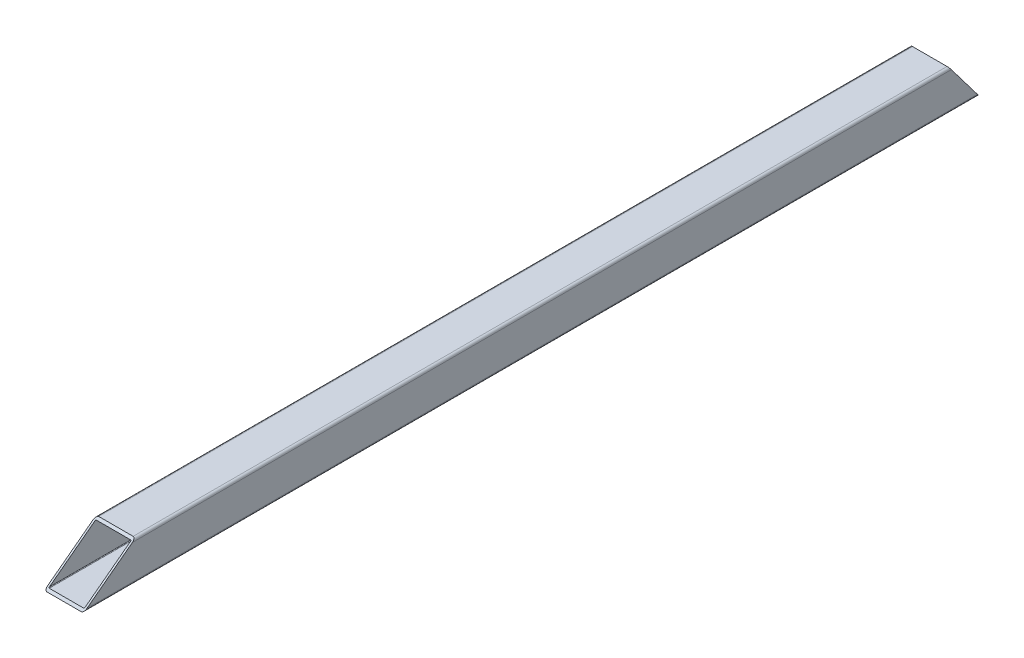
ISO-10303-21;
HEADER;
FILE_DESCRIPTION(('STEP AP214'),'2;1');
FILE_NAME('part.step','',(''),(''),'','','');
FILE_SCHEMA(('AUTOMOTIVE_DESIGN { 1 0 10303 214 1 1 1 1 }'));
ENDSEC;
DATA;
#1=APPLICATION_CONTEXT('core data for automotive mechanical design processes');
#2=APPLICATION_PROTOCOL_DEFINITION('international standard','automotive_design',2000,#1);
#3=PRODUCT_CONTEXT('',#1,'mechanical');
#4=PRODUCT('Part','Part','',(#3));
#5=PRODUCT_RELATED_PRODUCT_CATEGORY('part','',(#4));
#6=PRODUCT_DEFINITION_FORMATION('','',#4);
#7=PRODUCT_DEFINITION_CONTEXT('part definition',#1,'design');
#8=PRODUCT_DEFINITION('design','',#6,#7);
#9=PRODUCT_DEFINITION_SHAPE('','',#8);
#10=(LENGTH_UNIT() NAMED_UNIT(*) SI_UNIT(.MILLI.,.METRE.));
#11=(NAMED_UNIT(*) PLANE_ANGLE_UNIT() SI_UNIT($,.RADIAN.));
#12=(NAMED_UNIT(*) SI_UNIT($,.STERADIAN.) SOLID_ANGLE_UNIT());
#13=UNCERTAINTY_MEASURE_WITH_UNIT(LENGTH_MEASURE(1.E-05),#10,'distance_accuracy_value','');
#14=(GEOMETRIC_REPRESENTATION_CONTEXT(3) GLOBAL_UNCERTAINTY_ASSIGNED_CONTEXT((#13)) GLOBAL_UNIT_ASSIGNED_CONTEXT((#10,
#11,#12)) REPRESENTATION_CONTEXT('',''));
#15=CARTESIAN_POINT('',(0.,0.,0.));
#16=DIRECTION('',(0.,0.,1.));
#17=DIRECTION('',(1.,0.,0.));
#18=AXIS2_PLACEMENT_3D('',#15,#16,#17);
#19=CARTESIAN_POINT('',(14.,-14.,-364.5));
#20=DIRECTION('',(0.,0.,1.));
#21=DIRECTION('',(1.,0.,0.));
#22=AXIS2_PLACEMENT_3D('',#19,#20,#21);
#23=CYLINDRICAL_SURFACE('',#22,2.);
#24=CARTESIAN_POINT('',(14.,-14.,-362.986314140534));
#25=DIRECTION('',(0.,-0.603486360302473,0.797373320928707));
#26=DIRECTION('',(0.,0.797373320928707,0.603486360302473));
#27=AXIS2_PLACEMENT_3D('',#24,#25,#26);
#28=ELLIPSE('',#27,2.50823541182766,2.);
#29=CARTESIAN_POINT('',(16.,-14.,-362.986314140534));
#30=VERTEX_POINT('',#29);
#31=CARTESIAN_POINT('',(14.,-16.,-364.5));
#32=VERTEX_POINT('',#31);
#33=EDGE_CURVE('E246',#30,#32,#28,.F.);
#34=ORIENTED_EDGE('',*,*,#33,.F.);
#35=DIRECTION('',(0.,0.,1.));
#36=VECTOR('',#35,1.);
#37=CARTESIAN_POINT('',(16.,-14.,-364.5));
#38=LINE('',#37,#36);
#39=CARTESIAN_POINT('',(16.,-13.9999999999999,361.857443768807));
#40=VERTEX_POINT('',#39);
#41=EDGE_CURVE('E166',#30,#40,#38,.T.);
#42=ORIENTED_EDGE('',*,*,#41,.T.);
#43=CARTESIAN_POINT('',(14.,-14.,361.857443768807));
#44=DIRECTION('',(0.,-0.797373320928705,-0.603486360302475));
#45=DIRECTION('',(0.,-0.603486360302475,0.797373320928705));
#46=AXIS2_PLACEMENT_3D('',#43,#44,#45);
#47=ELLIPSE('',#46,3.31407655841232,2.);
#48=CARTESIAN_POINT('',(14.,-16.,364.5));
#49=VERTEX_POINT('',#48);
#50=EDGE_CURVE('E208',#49,#40,#47,.F.);
#51=ORIENTED_EDGE('',*,*,#50,.F.);
#52=DIRECTION('',(0.,0.,1.));
#53=VECTOR('',#52,1.);
#54=CARTESIAN_POINT('',(14.,-16.,-364.5));
#55=LINE('',#54,#53);
#56=EDGE_CURVE('E43',#32,#49,#55,.T.);
#57=ORIENTED_EDGE('',*,*,#56,.F.);
#58=EDGE_LOOP('',(#34,#42,#51,#57));
#59=FACE_BOUND('',#58,.T.);
#60=ADVANCED_FACE('F36',(#59),#23,.T.);
#61=CARTESIAN_POINT('',(-14.,-16.,-364.5));
#62=DIRECTION('',(0.,-1.,0.));
#63=DIRECTION('',(0.,0.,-1.));
#64=AXIS2_PLACEMENT_3D('',#61,#62,#63);
#65=PLANE('',#64);
#66=ORIENTED_EDGE('',*,*,#56,.T.);
#67=DIRECTION('',(1.,0.,0.));
#68=VECTOR('',#67,1.);
#69=CARTESIAN_POINT('',(-14.,-16.,364.5));
#70=LINE('',#69,#68);
#71=CARTESIAN_POINT('',(-14.,-16.,364.5));
#72=VERTEX_POINT('',#71);
#73=EDGE_CURVE('E194',#72,#49,#70,.T.);
#74=ORIENTED_EDGE('',*,*,#73,.F.);
#75=DIRECTION('',(0.,0.,1.));
#76=VECTOR('',#75,1.);
#77=CARTESIAN_POINT('',(-14.,-16.,-364.5));
#78=LINE('',#77,#76);
#79=CARTESIAN_POINT('',(-14.,-16.,-364.5));
#80=VERTEX_POINT('',#79);
#81=EDGE_CURVE('E184',#80,#72,#78,.T.);
#82=ORIENTED_EDGE('',*,*,#81,.F.);
#83=DIRECTION('',(1.,0.,0.));
#84=VECTOR('',#83,1.);
#85=CARTESIAN_POINT('',(-14.,-16.,-364.5));
#86=LINE('',#85,#84);
#87=EDGE_CURVE('E177',#80,#32,#86,.T.);
#88=ORIENTED_EDGE('',*,*,#87,.T.);
#89=EDGE_LOOP('',(#66,#74,#82,#88));
#90=FACE_BOUND('',#89,.T.);
#91=ADVANCED_FACE('F299',(#90),#65,.T.);
#92=CARTESIAN_POINT('',(-14.,-14.,-364.5));
#93=DIRECTION('',(0.,0.,1.));
#94=DIRECTION('',(1.,0.,0.));
#95=AXIS2_PLACEMENT_3D('',#92,#93,#94);
#96=CYLINDRICAL_SURFACE('',#95,2.);
#97=CARTESIAN_POINT('',(-14.,-14.,-362.986314140534));
#98=DIRECTION('',(0.,-0.603486360302473,0.797373320928707));
#99=DIRECTION('',(0.,0.797373320928707,0.603486360302473));
#100=AXIS2_PLACEMENT_3D('',#97,#98,#99);
#101=ELLIPSE('',#100,2.50823541182766,2.);
#102=CARTESIAN_POINT('',(-16.,-14.,-362.986314140534));
#103=VERTEX_POINT('',#102);
#104=EDGE_CURVE('E250',#80,#103,#101,.F.);
#105=ORIENTED_EDGE('',*,*,#104,.F.);
#106=ORIENTED_EDGE('',*,*,#81,.T.);
#107=CARTESIAN_POINT('',(-14.,-14.,361.857443768807));
#108=DIRECTION('',(0.,-0.797373320928705,-0.603486360302475));
#109=DIRECTION('',(0.,-0.603486360302475,0.797373320928705));
#110=AXIS2_PLACEMENT_3D('',#107,#108,#109);
#111=ELLIPSE('',#110,3.31407655841232,2.);
#112=CARTESIAN_POINT('',(-16.,-13.9999999999999,361.857443768807));
#113=VERTEX_POINT('',#112);
#114=EDGE_CURVE('E211',#113,#72,#111,.F.);
#115=ORIENTED_EDGE('',*,*,#114,.F.);
#116=DIRECTION('',(0.,0.,1.));
#117=VECTOR('',#116,1.);
#118=CARTESIAN_POINT('',(-16.,-14.,-364.5));
#119=LINE('',#118,#117);
#120=EDGE_CURVE('E182',#103,#113,#119,.T.);
#121=ORIENTED_EDGE('',*,*,#120,.F.);
#122=EDGE_LOOP('',(#105,#106,#115,#121));
#123=FACE_BOUND('',#122,.T.);
#124=ADVANCED_FACE('F282',(#123),#96,.T.);
#125=CARTESIAN_POINT('',(-16.,-14.,-364.5));
#126=DIRECTION('',(-1.,0.,0.));
#127=DIRECTION('',(0.,0.,1.));
#128=AXIS2_PLACEMENT_3D('',#125,#126,#127);
#129=PLANE('',#128);
#130=DIRECTION('',(0.,-0.797373320928707,-0.603486360302473));
#131=VECTOR('',#130,1.);
#132=CARTESIAN_POINT('',(-16.,-16.,-364.5));
#133=LINE('',#132,#131);
#134=CARTESIAN_POINT('',(-16.,14.,-341.794712108015));
#135=VERTEX_POINT('',#134);
#136=EDGE_CURVE('E167',#135,#103,#133,.T.);
#137=ORIENTED_EDGE('',*,*,#136,.T.);
#138=ORIENTED_EDGE('',*,*,#120,.T.);
#139=DIRECTION('',(0.,0.603486360302475,-0.797373320928705));
#140=VECTOR('',#139,1.);
#141=CARTESIAN_POINT('',(-16.,-16.,364.5));
#142=LINE('',#141,#140);
#143=CARTESIAN_POINT('',(-16.,14.,324.861656532102));
#144=VERTEX_POINT('',#143);
#145=EDGE_CURVE('E243',#113,#144,#142,.T.);
#146=ORIENTED_EDGE('',*,*,#145,.T.);
#147=DIRECTION('',(0.,0.,1.));
#148=VECTOR('',#147,1.);
#149=CARTESIAN_POINT('',(-16.,14.,-364.5));
#150=LINE('',#149,#148);
#151=EDGE_CURVE('E180',#135,#144,#150,.T.);
#152=ORIENTED_EDGE('',*,*,#151,.F.);
#153=EDGE_LOOP('',(#137,#138,#146,#152));
#154=FACE_BOUND('',#153,.T.);
#155=ADVANCED_FACE('F276',(#154),#129,.T.);
#156=CARTESIAN_POINT('',(-14.,14.,-364.5));
#157=DIRECTION('',(0.,0.,1.));
#158=DIRECTION('',(1.,0.,0.));
#159=AXIS2_PLACEMENT_3D('',#156,#157,#158);
#160=CYLINDRICAL_SURFACE('',#159,2.);
#161=CARTESIAN_POINT('',(-14.,14.,-341.794712108015));
#162=DIRECTION('',(0.,-0.603486360302473,0.797373320928707));
#163=DIRECTION('',(0.,0.797373320928707,0.603486360302473));
#164=AXIS2_PLACEMENT_3D('',#161,#162,#163);
#165=ELLIPSE('',#164,2.50823541182766,2.);
#166=CARTESIAN_POINT('',(-14.,16.,-340.28102624855));
#167=VERTEX_POINT('',#166);
#168=EDGE_CURVE('E158',#135,#167,#165,.F.);
#169=ORIENTED_EDGE('',*,*,#168,.F.);
#170=ORIENTED_EDGE('',*,*,#151,.T.);
#171=CARTESIAN_POINT('',(-14.,14.,324.861656532102));
#172=DIRECTION('',(0.,-0.797373320928705,-0.603486360302475));
#173=DIRECTION('',(0.,-0.603486360302475,0.797373320928705));
#174=AXIS2_PLACEMENT_3D('',#171,#172,#173);
#175=ELLIPSE('',#174,3.31407655841232,2.);
#176=CARTESIAN_POINT('',(-14.,16.,322.219100300909));
#177=VERTEX_POINT('',#176);
#178=EDGE_CURVE('E213',#177,#144,#175,.F.);
#179=ORIENTED_EDGE('',*,*,#178,.F.);
#180=DIRECTION('',(0.,0.,1.));
#181=VECTOR('',#180,1.);
#182=CARTESIAN_POINT('',(-14.,16.,-364.5));
#183=LINE('',#182,#181);
#184=EDGE_CURVE('E175',#167,#177,#183,.T.);
#185=ORIENTED_EDGE('',*,*,#184,.F.);
#186=EDGE_LOOP('',(#169,#170,#179,#185));
#187=FACE_BOUND('',#186,.T.);
#188=ADVANCED_FACE('F293',(#187),#160,.T.);
#189=CARTESIAN_POINT('',(-14.,16.,-364.5));
#190=DIRECTION('',(0.,1.,0.));
#191=DIRECTION('',(0.,0.,1.));
#192=AXIS2_PLACEMENT_3D('',#189,#190,#191);
#193=PLANE('',#192);
#194=DIRECTION('',(1.,0.,0.));
#195=VECTOR('',#194,1.);
#196=CARTESIAN_POINT('',(-16.,16.,-340.28102624855));
#197=LINE('',#196,#195);
#198=CARTESIAN_POINT('',(14.,16.,-340.28102624855));
#199=VERTEX_POINT('',#198);
#200=EDGE_CURVE('E154',#167,#199,#197,.T.);
#201=ORIENTED_EDGE('',*,*,#200,.F.);
#202=ORIENTED_EDGE('',*,*,#184,.T.);
#203=DIRECTION('',(1.,0.,0.));
#204=VECTOR('',#203,1.);
#205=CARTESIAN_POINT('',(-16.,16.,322.219100300909));
#206=LINE('',#205,#204);
#207=CARTESIAN_POINT('',(14.,16.,322.219100300909));
#208=VERTEX_POINT('',#207);
#209=EDGE_CURVE('E240',#177,#208,#206,.T.);
#210=ORIENTED_EDGE('',*,*,#209,.T.);
#211=DIRECTION('',(0.,0.,1.));
#212=VECTOR('',#211,1.);
#213=CARTESIAN_POINT('',(14.,16.,-364.5));
#214=LINE('',#213,#212);
#215=EDGE_CURVE('E173',#199,#208,#214,.T.);
#216=ORIENTED_EDGE('',*,*,#215,.F.);
#217=EDGE_LOOP('',(#201,#202,#210,#216));
#218=FACE_BOUND('',#217,.T.);
#219=ADVANCED_FACE('F295',(#218),#193,.T.);
#220=CARTESIAN_POINT('',(14.,14.,-364.5));
#221=DIRECTION('',(0.,0.,1.));
#222=DIRECTION('',(1.,0.,0.));
#223=AXIS2_PLACEMENT_3D('',#220,#221,#222);
#224=CYLINDRICAL_SURFACE('',#223,2.);
#225=CARTESIAN_POINT('',(14.,14.,-341.794712108015));
#226=DIRECTION('',(0.,-0.603486360302473,0.797373320928707));
#227=DIRECTION('',(0.,0.797373320928707,0.603486360302473));
#228=AXIS2_PLACEMENT_3D('',#225,#226,#227);
#229=ELLIPSE('',#228,2.50823541182766,2.);
#230=CARTESIAN_POINT('',(16.,14.,-341.794712108015));
#231=VERTEX_POINT('',#230);
#232=EDGE_CURVE('E148',#199,#231,#229,.F.);
#233=ORIENTED_EDGE('',*,*,#232,.F.);
#234=ORIENTED_EDGE('',*,*,#215,.T.);
#235=CARTESIAN_POINT('',(14.,14.,324.861656532102));
#236=DIRECTION('',(0.,-0.797373320928705,-0.603486360302475));
#237=DIRECTION('',(0.,-0.603486360302475,0.797373320928705));
#238=AXIS2_PLACEMENT_3D('',#235,#236,#237);
#239=ELLIPSE('',#238,3.31407655841232,2.);
#240=CARTESIAN_POINT('',(16.,14.,324.861656532102));
#241=VERTEX_POINT('',#240);
#242=EDGE_CURVE('E172',#241,#208,#239,.F.);
#243=ORIENTED_EDGE('',*,*,#242,.F.);
#244=DIRECTION('',(0.,0.,1.));
#245=VECTOR('',#244,1.);
#246=CARTESIAN_POINT('',(16.,14.,-364.5));
#247=LINE('',#246,#245);
#248=EDGE_CURVE('E164',#231,#241,#247,.T.);
#249=ORIENTED_EDGE('',*,*,#248,.F.);
#250=EDGE_LOOP('',(#233,#234,#243,#249));
#251=FACE_BOUND('',#250,.T.);
#252=ADVANCED_FACE('F170',(#251),#224,.T.);
#253=CARTESIAN_POINT('',(16.,-14.,-364.5));
#254=DIRECTION('',(1.,0.,0.));
#255=DIRECTION('',(0.,0.,-1.));
#256=AXIS2_PLACEMENT_3D('',#253,#254,#255);
#257=PLANE('',#256);
#258=DIRECTION('',(0.,-0.797373320928707,-0.603486360302473));
#259=VECTOR('',#258,1.);
#260=CARTESIAN_POINT('',(16.,-16.,-364.5));
#261=LINE('',#260,#259);
#262=EDGE_CURVE('E151',#231,#30,#261,.T.);
#263=ORIENTED_EDGE('',*,*,#262,.F.);
#264=ORIENTED_EDGE('',*,*,#248,.T.);
#265=DIRECTION('',(0.,0.603486360302475,-0.797373320928705));
#266=VECTOR('',#265,1.);
#267=CARTESIAN_POINT('',(16.,-16.,364.5));
#268=LINE('',#267,#266);
#269=EDGE_CURVE('E244',#40,#241,#268,.T.);
#270=ORIENTED_EDGE('',*,*,#269,.F.);
#271=ORIENTED_EDGE('',*,*,#41,.F.);
#272=EDGE_LOOP('',(#263,#264,#270,#271));
#273=FACE_BOUND('',#272,.T.);
#274=ADVANCED_FACE('F162',(#273),#257,.T.);
#275=CARTESIAN_POINT('',(-14.,14.,-364.5));
#276=DIRECTION('',(0.,0.,1.));
#277=DIRECTION('',(1.,0.,0.));
#278=AXIS2_PLACEMENT_3D('',#275,#276,#277);
#279=CYLINDRICAL_SURFACE('',#278,0.48);
#280=DIRECTION('',(0.,0.,1.));
#281=VECTOR('',#280,1.);
#282=CARTESIAN_POINT('',(-14.48,14.,-364.5));
#283=LINE('',#282,#281);
#284=CARTESIAN_POINT('',(-14.48,14.,-341.794712108015));
#285=VERTEX_POINT('',#284);
#286=CARTESIAN_POINT('',(-14.48,14.,324.861656532102));
#287=VERTEX_POINT('',#286);
#288=EDGE_CURVE('E192',#285,#287,#283,.T.);
#289=ORIENTED_EDGE('',*,*,#288,.F.);
#290=CARTESIAN_POINT('',(-14.,14.,-341.794712108015));
#291=DIRECTION('',(0.,-0.603486360302473,0.797373320928707));
#292=DIRECTION('',(0.,0.797373320928707,0.603486360302473));
#293=AXIS2_PLACEMENT_3D('',#290,#291,#292);
#294=ELLIPSE('',#293,0.601976498838637,0.48);
#295=CARTESIAN_POINT('',(-14.,14.48,-341.431427501744));
#296=VERTEX_POINT('',#295);
#297=EDGE_CURVE('E50',#285,#296,#294,.F.);
#298=ORIENTED_EDGE('',*,*,#297,.T.);
#299=DIRECTION('',(0.,0.,1.));
#300=VECTOR('',#299,1.);
#301=CARTESIAN_POINT('',(-14.,14.48,-364.5));
#302=LINE('',#301,#300);
#303=CARTESIAN_POINT('',(-14.,14.48,324.227443036616));
#304=VERTEX_POINT('',#303);
#305=EDGE_CURVE('E191',#296,#304,#302,.T.);
#306=ORIENTED_EDGE('',*,*,#305,.T.);
#307=CARTESIAN_POINT('',(-14.,14.,324.861656532102));
#308=DIRECTION('',(0.,-0.797373320928705,-0.603486360302475));
#309=DIRECTION('',(0.,-0.603486360302475,0.797373320928705));
#310=AXIS2_PLACEMENT_3D('',#307,#308,#309);
#311=ELLIPSE('',#310,0.795378374018955,0.48);
#312=EDGE_CURVE('E217',#304,#287,#311,.F.);
#313=ORIENTED_EDGE('',*,*,#312,.T.);
#314=EDGE_LOOP('',(#289,#298,#306,#313));
#315=FACE_BOUND('',#314,.T.);
#316=ADVANCED_FACE('F308',(#315),#279,.F.);
#317=CARTESIAN_POINT('',(-14.,14.48,-364.5));
#318=DIRECTION('',(0.,1.,0.));
#319=DIRECTION('',(0.,0.,1.));
#320=AXIS2_PLACEMENT_3D('',#317,#318,#319);
#321=PLANE('',#320);
#322=ORIENTED_EDGE('',*,*,#305,.F.);
#323=DIRECTION('',(1.,0.,0.));
#324=VECTOR('',#323,1.);
#325=CARTESIAN_POINT('',(-14.,14.48,-341.431427501744));
#326=LINE('',#325,#324);
#327=CARTESIAN_POINT('',(14.,14.48,-341.431427501744));
#328=VERTEX_POINT('',#327);
#329=EDGE_CURVE('E254',#296,#328,#326,.T.);
#330=ORIENTED_EDGE('',*,*,#329,.T.);
#331=DIRECTION('',(0.,0.,1.));
#332=VECTOR('',#331,1.);
#333=CARTESIAN_POINT('',(14.,14.48,-364.5));
#334=LINE('',#333,#332);
#335=CARTESIAN_POINT('',(14.,14.48,324.227443036616));
#336=VERTEX_POINT('',#335);
#337=EDGE_CURVE('E204',#328,#336,#334,.T.);
#338=ORIENTED_EDGE('',*,*,#337,.T.);
#339=DIRECTION('',(-1.,0.,0.));
#340=VECTOR('',#339,1.);
#341=CARTESIAN_POINT('',(-14.,14.48,324.227443036616));
#342=LINE('',#341,#340);
#343=EDGE_CURVE('E220',#336,#304,#342,.T.);
#344=ORIENTED_EDGE('',*,*,#343,.T.);
#345=EDGE_LOOP('',(#322,#330,#338,#344));
#346=FACE_BOUND('',#345,.T.);
#347=ADVANCED_FACE('F322',(#346),#321,.F.);
#348=CARTESIAN_POINT('',(14.,14.,-364.5));
#349=DIRECTION('',(0.,0.,1.));
#350=DIRECTION('',(1.,0.,0.));
#351=AXIS2_PLACEMENT_3D('',#348,#349,#350);
#352=CYLINDRICAL_SURFACE('',#351,0.48);
#353=ORIENTED_EDGE('',*,*,#337,.F.);
#354=CARTESIAN_POINT('',(14.,14.,-341.794712108015));
#355=DIRECTION('',(0.,-0.603486360302473,0.797373320928707));
#356=DIRECTION('',(0.,0.797373320928707,0.603486360302473));
#357=AXIS2_PLACEMENT_3D('',#354,#355,#356);
#358=ELLIPSE('',#357,0.601976498838637,0.48);
#359=CARTESIAN_POINT('',(14.48,14.,-341.794712108015));
#360=VERTEX_POINT('',#359);
#361=EDGE_CURVE('E257',#328,#360,#358,.F.);
#362=ORIENTED_EDGE('',*,*,#361,.T.);
#363=DIRECTION('',(0.,0.,1.));
#364=VECTOR('',#363,1.);
#365=CARTESIAN_POINT('',(14.48,14.,-364.5));
#366=LINE('',#365,#364);
#367=CARTESIAN_POINT('',(14.48,14.,324.861656532102));
#368=VERTEX_POINT('',#367);
#369=EDGE_CURVE('E202',#360,#368,#366,.T.);
#370=ORIENTED_EDGE('',*,*,#369,.T.);
#371=CARTESIAN_POINT('',(14.,14.,324.861656532102));
#372=DIRECTION('',(0.,-0.797373320928705,-0.603486360302475));
#373=DIRECTION('',(0.,-0.603486360302475,0.797373320928705));
#374=AXIS2_PLACEMENT_3D('',#371,#372,#373);
#375=ELLIPSE('',#374,0.795378374018955,0.48);
#376=EDGE_CURVE('E223',#368,#336,#375,.F.);
#377=ORIENTED_EDGE('',*,*,#376,.T.);
#378=EDGE_LOOP('',(#353,#362,#370,#377));
#379=FACE_BOUND('',#378,.T.);
#380=ADVANCED_FACE('F327',(#379),#352,.F.);
#381=CARTESIAN_POINT('',(14.48,-14.,-364.5));
#382=DIRECTION('',(1.,0.,0.));
#383=DIRECTION('',(0.,0.,-1.));
#384=AXIS2_PLACEMENT_3D('',#381,#382,#383);
#385=PLANE('',#384);
#386=ORIENTED_EDGE('',*,*,#369,.F.);
#387=DIRECTION('',(0.,-0.797373320928707,-0.603486360302473));
#388=VECTOR('',#387,1.);
#389=CARTESIAN_POINT('',(14.48,-14.7283915741422,-363.537592153501));
#390=LINE('',#389,#388);
#391=CARTESIAN_POINT('',(14.48,-14.,-362.986314140534));
#392=VERTEX_POINT('',#391);
#393=EDGE_CURVE('E260',#360,#392,#390,.T.);
#394=ORIENTED_EDGE('',*,*,#393,.T.);
#395=DIRECTION('',(0.,0.,1.));
#396=VECTOR('',#395,1.);
#397=CARTESIAN_POINT('',(14.48,-14.,-364.5));
#398=LINE('',#397,#396);
#399=CARTESIAN_POINT('',(14.48,-14.,361.857443768807));
#400=VERTEX_POINT('',#399);
#401=EDGE_CURVE('E200',#392,#400,#398,.T.);
#402=ORIENTED_EDGE('',*,*,#401,.T.);
#403=DIRECTION('',(0.,0.603486360302475,-0.797373320928705));
#404=VECTOR('',#403,1.);
#405=CARTESIAN_POINT('',(14.48,335.526051623072,-99.9636790716466));
#406=LINE('',#405,#404);
#407=EDGE_CURVE('E226',#400,#368,#406,.T.);
#408=ORIENTED_EDGE('',*,*,#407,.T.);
#409=EDGE_LOOP('',(#386,#394,#402,#408));
#410=FACE_BOUND('',#409,.T.);
#411=ADVANCED_FACE('F350',(#410),#385,.F.);
#412=CARTESIAN_POINT('',(14.,-14.,-364.5));
#413=DIRECTION('',(0.,0.,1.));
#414=DIRECTION('',(1.,0.,0.));
#415=AXIS2_PLACEMENT_3D('',#412,#413,#414);
#416=CYLINDRICAL_SURFACE('',#415,0.48);
#417=ORIENTED_EDGE('',*,*,#401,.F.);
#418=CARTESIAN_POINT('',(14.,-14.,-362.986314140534));
#419=DIRECTION('',(0.,-0.603486360302473,0.797373320928707));
#420=DIRECTION('',(0.,0.797373320928707,0.603486360302473));
#421=AXIS2_PLACEMENT_3D('',#418,#419,#420);
#422=ELLIPSE('',#421,0.601976498838637,0.48);
#423=CARTESIAN_POINT('',(14.,-14.48,-363.349598746806));
#424=VERTEX_POINT('',#423);
#425=EDGE_CURVE('E263',#392,#424,#422,.F.);
#426=ORIENTED_EDGE('',*,*,#425,.T.);
#427=DIRECTION('',(0.,0.,1.));
#428=VECTOR('',#427,1.);
#429=CARTESIAN_POINT('',(14.,-14.48,-364.5));
#430=LINE('',#429,#428);
#431=CARTESIAN_POINT('',(14.,-14.48,362.491657264293));
#432=VERTEX_POINT('',#431);
#433=EDGE_CURVE('E198',#424,#432,#430,.T.);
#434=ORIENTED_EDGE('',*,*,#433,.T.);
#435=CARTESIAN_POINT('',(14.,-14.,361.857443768807));
#436=DIRECTION('',(0.,-0.797373320928705,-0.603486360302475));
#437=DIRECTION('',(0.,-0.603486360302475,0.797373320928705));
#438=AXIS2_PLACEMENT_3D('',#435,#436,#437);
#439=ELLIPSE('',#438,0.795378374018955,0.48);
#440=EDGE_CURVE('E229',#432,#400,#439,.F.);
#441=ORIENTED_EDGE('',*,*,#440,.T.);
#442=EDGE_LOOP('',(#417,#426,#434,#441));
#443=FACE_BOUND('',#442,.T.);
#444=ADVANCED_FACE('F346',(#443),#416,.F.);
#445=CARTESIAN_POINT('',(-14.,-14.48,-364.5));
#446=DIRECTION('',(0.,-1.,0.));
#447=DIRECTION('',(0.,0.,-1.));
#448=AXIS2_PLACEMENT_3D('',#445,#446,#447);
#449=PLANE('',#448);
#450=ORIENTED_EDGE('',*,*,#433,.F.);
#451=DIRECTION('',(-1.,0.,0.));
#452=VECTOR('',#451,1.);
#453=CARTESIAN_POINT('',(-14.,-14.48,-363.349598746806));
#454=LINE('',#453,#452);
#455=CARTESIAN_POINT('',(-14.,-14.48,-363.349598746806));
#456=VERTEX_POINT('',#455);
#457=EDGE_CURVE('E266',#424,#456,#454,.T.);
#458=ORIENTED_EDGE('',*,*,#457,.T.);
#459=DIRECTION('',(0.,0.,1.));
#460=VECTOR('',#459,1.);
#461=CARTESIAN_POINT('',(-14.,-14.48,-364.5));
#462=LINE('',#461,#460);
#463=CARTESIAN_POINT('',(-14.,-14.48,362.491657264293));
#464=VERTEX_POINT('',#463);
#465=EDGE_CURVE('E196',#456,#464,#462,.T.);
#466=ORIENTED_EDGE('',*,*,#465,.T.);
#467=DIRECTION('',(1.,0.,0.));
#468=VECTOR('',#467,1.);
#469=CARTESIAN_POINT('',(-14.,-14.48,362.491657264293));
#470=LINE('',#469,#468);
#471=EDGE_CURVE('E232',#464,#432,#470,.T.);
#472=ORIENTED_EDGE('',*,*,#471,.T.);
#473=EDGE_LOOP('',(#450,#458,#466,#472));
#474=FACE_BOUND('',#473,.T.);
#475=ADVANCED_FACE('F343',(#474),#449,.F.);
#476=CARTESIAN_POINT('',(-14.,-14.,-364.5));
#477=DIRECTION('',(0.,0.,1.));
#478=DIRECTION('',(1.,0.,0.));
#479=AXIS2_PLACEMENT_3D('',#476,#477,#478);
#480=CYLINDRICAL_SURFACE('',#479,0.48);
#481=ORIENTED_EDGE('',*,*,#465,.F.);
#482=CARTESIAN_POINT('',(-14.,-14.,-362.986314140534));
#483=DIRECTION('',(0.,-0.603486360302473,0.797373320928707));
#484=DIRECTION('',(0.,0.797373320928707,0.603486360302473));
#485=AXIS2_PLACEMENT_3D('',#482,#483,#484);
#486=ELLIPSE('',#485,0.601976498838637,0.48);
#487=CARTESIAN_POINT('',(-14.48,-14.,-362.986314140534));
#488=VERTEX_POINT('',#487);
#489=EDGE_CURVE('E269',#456,#488,#486,.F.);
#490=ORIENTED_EDGE('',*,*,#489,.T.);
#491=DIRECTION('',(0.,0.,1.));
#492=VECTOR('',#491,1.);
#493=CARTESIAN_POINT('',(-14.48,-14.,-364.5));
#494=LINE('',#493,#492);
#495=CARTESIAN_POINT('',(-14.48,-14.,361.857443768807));
#496=VERTEX_POINT('',#495);
#497=EDGE_CURVE('E57',#488,#496,#494,.T.);
#498=ORIENTED_EDGE('',*,*,#497,.T.);
#499=CARTESIAN_POINT('',(-14.,-14.,361.857443768807));
#500=DIRECTION('',(0.,-0.797373320928705,-0.603486360302475));
#501=DIRECTION('',(0.,-0.603486360302475,0.797373320928705));
#502=AXIS2_PLACEMENT_3D('',#499,#500,#501);
#503=ELLIPSE('',#502,0.795378374018955,0.48);
#504=EDGE_CURVE('E235',#496,#464,#503,.F.);
#505=ORIENTED_EDGE('',*,*,#504,.T.);
#506=EDGE_LOOP('',(#481,#490,#498,#505));
#507=FACE_BOUND('',#506,.T.);
#508=ADVANCED_FACE('F340',(#507),#480,.F.);
#509=CARTESIAN_POINT('',(-14.48,-14.,-364.5));
#510=DIRECTION('',(-1.,0.,0.));
#511=DIRECTION('',(0.,0.,1.));
#512=AXIS2_PLACEMENT_3D('',#509,#510,#511);
#513=PLANE('',#512);
#514=ORIENTED_EDGE('',*,*,#497,.F.);
#515=DIRECTION('',(0.,0.797373320928707,0.603486360302473));
#516=VECTOR('',#515,1.);
#517=CARTESIAN_POINT('',(-14.48,-14.7283915741423,-363.537592153501));
#518=LINE('',#517,#516);
#519=EDGE_CURVE('E11',#488,#285,#518,.T.);
#520=ORIENTED_EDGE('',*,*,#519,.T.);
#521=ORIENTED_EDGE('',*,*,#288,.T.);
#522=DIRECTION('',(0.,-0.603486360302475,0.797373320928705));
#523=VECTOR('',#522,1.);
#524=CARTESIAN_POINT('',(-14.48,335.526051623072,-99.9636790716466));
#525=LINE('',#524,#523);
#526=EDGE_CURVE('E237',#287,#496,#525,.T.);
#527=ORIENTED_EDGE('',*,*,#526,.T.);
#528=EDGE_LOOP('',(#514,#520,#521,#527));
#529=FACE_BOUND('',#528,.T.);
#530=ADVANCED_FACE('F335',(#529),#513,.F.);
#531=CARTESIAN_POINT('',(-16.,-16.,364.5));
#532=DIRECTION('',(0.,-0.797373320928705,-0.603486360302475));
#533=DIRECTION('',(0.,0.603486360302475,-0.797373320928705));
#534=AXIS2_PLACEMENT_3D('',#531,#532,#533);
#535=PLANE('',#534);
#536=ORIENTED_EDGE('',*,*,#50,.T.);
#537=ORIENTED_EDGE('',*,*,#269,.T.);
#538=ORIENTED_EDGE('',*,*,#242,.T.);
#539=ORIENTED_EDGE('',*,*,#209,.F.);
#540=ORIENTED_EDGE('',*,*,#178,.T.);
#541=ORIENTED_EDGE('',*,*,#145,.F.);
#542=ORIENTED_EDGE('',*,*,#114,.T.);
#543=ORIENTED_EDGE('',*,*,#73,.T.);
#544=EDGE_LOOP('',(#536,#537,#538,#539,#540,#541,#542,#543));
#545=FACE_BOUND('',#544,.T.);
#546=ORIENTED_EDGE('',*,*,#343,.F.);
#547=ORIENTED_EDGE('',*,*,#376,.F.);
#548=ORIENTED_EDGE('',*,*,#407,.F.);
#549=ORIENTED_EDGE('',*,*,#440,.F.);
#550=ORIENTED_EDGE('',*,*,#471,.F.);
#551=ORIENTED_EDGE('',*,*,#504,.F.);
#552=ORIENTED_EDGE('',*,*,#526,.F.);
#553=ORIENTED_EDGE('',*,*,#312,.F.);
#554=EDGE_LOOP('',(#546,#547,#548,#549,#550,#551,#552,#553));
#555=FACE_BOUND('',#554,.T.);
#556=ADVANCED_FACE('F286',(#545,#555),#535,.F.);
#557=CARTESIAN_POINT('',(-16.,-16.,-364.5));
#558=DIRECTION('',(0.,-0.603486360302473,0.797373320928707));
#559=DIRECTION('',(0.,-0.797373320928707,-0.603486360302473));
#560=AXIS2_PLACEMENT_3D('',#557,#558,#559);
#561=PLANE('',#560);
#562=ORIENTED_EDGE('',*,*,#33,.T.);
#563=ORIENTED_EDGE('',*,*,#87,.F.);
#564=ORIENTED_EDGE('',*,*,#104,.T.);
#565=ORIENTED_EDGE('',*,*,#136,.F.);
#566=ORIENTED_EDGE('',*,*,#168,.T.);
#567=ORIENTED_EDGE('',*,*,#200,.T.);
#568=ORIENTED_EDGE('',*,*,#232,.T.);
#569=ORIENTED_EDGE('',*,*,#262,.T.);
#570=EDGE_LOOP('',(#562,#563,#564,#565,#566,#567,#568,#569));
#571=FACE_BOUND('',#570,.T.);
#572=ORIENTED_EDGE('',*,*,#519,.F.);
#573=ORIENTED_EDGE('',*,*,#489,.F.);
#574=ORIENTED_EDGE('',*,*,#457,.F.);
#575=ORIENTED_EDGE('',*,*,#425,.F.);
#576=ORIENTED_EDGE('',*,*,#393,.F.);
#577=ORIENTED_EDGE('',*,*,#361,.F.);
#578=ORIENTED_EDGE('',*,*,#329,.F.);
#579=ORIENTED_EDGE('',*,*,#297,.F.);
#580=EDGE_LOOP('',(#572,#573,#574,#575,#576,#577,#578,#579));
#581=FACE_BOUND('',#580,.T.);
#582=ADVANCED_FACE('F150',(#571,#581),#561,.F.);
#583=CLOSED_SHELL('',(#60,#91,#124,#155,#188,#219,#252,#274,#316,#347,#380,#411,#444,#475,#508,
#530,#556,#582));
#584=MANIFOLD_SOLID_BREP('B2',#583);
#585=ADVANCED_BREP_SHAPE_REPRESENTATION('',(#18,#584),#14);
#586=SHAPE_DEFINITION_REPRESENTATION(#9,#585);
ENDSEC;
END-ISO-10303-21;
